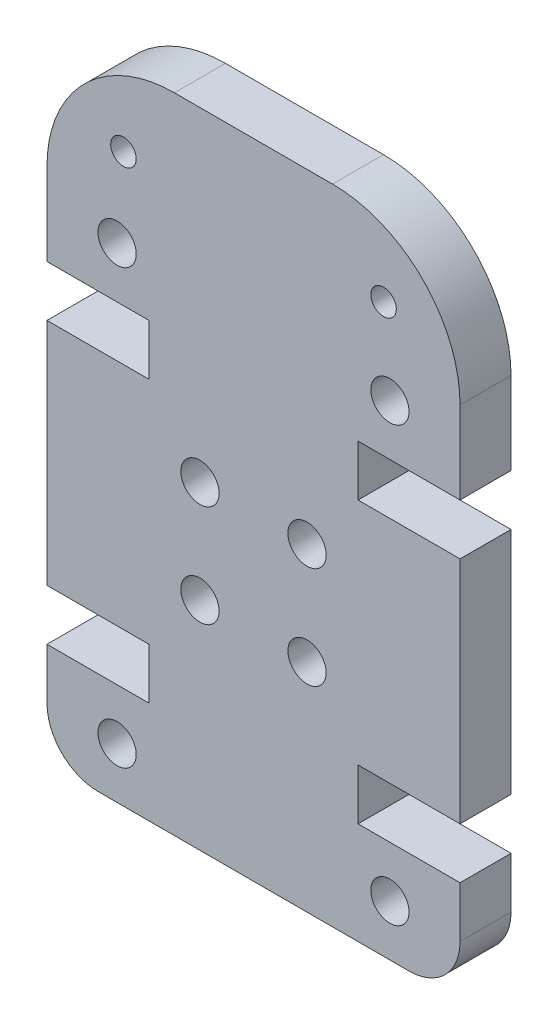
ISO-10303-21;
HEADER;
FILE_DESCRIPTION(('STEP AP214'),'2;1');
FILE_NAME('part.step','',(''),(''),'','','');
FILE_SCHEMA(('AUTOMOTIVE_DESIGN { 1 0 10303 214 1 1 1 1 }'));
ENDSEC;
DATA;
#1=APPLICATION_CONTEXT('core data for automotive mechanical design processes');
#2=APPLICATION_PROTOCOL_DEFINITION('international standard','automotive_design',2000,#1);
#3=PRODUCT_CONTEXT('',#1,'mechanical');
#4=PRODUCT('Part','Part','',(#3));
#5=PRODUCT_RELATED_PRODUCT_CATEGORY('part','',(#4));
#6=PRODUCT_DEFINITION_FORMATION('','',#4);
#7=PRODUCT_DEFINITION_CONTEXT('part definition',#1,'design');
#8=PRODUCT_DEFINITION('design','',#6,#7);
#9=PRODUCT_DEFINITION_SHAPE('','',#8);
#10=(LENGTH_UNIT() NAMED_UNIT(*) SI_UNIT(.MILLI.,.METRE.));
#11=(NAMED_UNIT(*) PLANE_ANGLE_UNIT() SI_UNIT($,.RADIAN.));
#12=(NAMED_UNIT(*) SI_UNIT($,.STERADIAN.) SOLID_ANGLE_UNIT());
#13=UNCERTAINTY_MEASURE_WITH_UNIT(LENGTH_MEASURE(1.E-05),#10,'distance_accuracy_value','');
#14=(GEOMETRIC_REPRESENTATION_CONTEXT(3) GLOBAL_UNCERTAINTY_ASSIGNED_CONTEXT((#13)) GLOBAL_UNIT_ASSIGNED_CONTEXT((#10,
#11,#12)) REPRESENTATION_CONTEXT('',''));
#15=CARTESIAN_POINT('',(0.,0.,0.));
#16=DIRECTION('',(0.,0.,1.));
#17=DIRECTION('',(1.,0.,0.));
#18=AXIS2_PLACEMENT_3D('',#15,#16,#17);
#19=CARTESIAN_POINT('',(14.2,2.00000000000003,2.));
#20=DIRECTION('',(0.,0.,-1.));
#21=DIRECTION('',(-1.,0.,0.));
#22=AXIS2_PLACEMENT_3D('',#19,#20,#21);
#23=PLANE('',#22);
#24=CARTESIAN_POINT('',(3.00000000000323,22.2299999999968,2.));
#25=DIRECTION('',(0.,0.,1.));
#26=DIRECTION('',(1.,0.,0.));
#27=AXIS2_PLACEMENT_3D('',#24,#25,#26);
#28=CIRCLE('',#27,0.499999999999944);
#29=CARTESIAN_POINT('',(3.50000000000317,22.2299999999968,2.));
#30=VERTEX_POINT('',#29);
#31=EDGE_CURVE('E472',#30,#30,#28,.T.);
#32=ORIENTED_EDGE('',*,*,#31,.F.);
#33=EDGE_LOOP('',(#32));
#34=FACE_BOUND('',#33,.T.);
#35=CARTESIAN_POINT('',(2.75000000000002,19.0000000000043,2.));
#36=DIRECTION('',(0.,0.,1.));
#37=DIRECTION('',(-1.,0.,0.));
#38=AXIS2_PLACEMENT_3D('',#35,#36,#37);
#39=CIRCLE('',#38,0.749999999999999);
#40=CARTESIAN_POINT('',(2.00000000000002,19.0000000000043,2.));
#41=VERTEX_POINT('',#40);
#42=EDGE_CURVE('E484',#41,#41,#39,.T.);
#43=ORIENTED_EDGE('',*,*,#42,.F.);
#44=EDGE_LOOP('',(#43));
#45=FACE_BOUND('',#44,.T.);
#46=CARTESIAN_POINT('',(10.1999999999989,12.5000000000022,2.));
#47=DIRECTION('',(0.,0.,1.));
#48=DIRECTION('',(1.,0.,0.));
#49=AXIS2_PLACEMENT_3D('',#46,#47,#48);
#50=CIRCLE('',#49,0.749999999999998);
#51=CARTESIAN_POINT('',(10.9499999999989,12.5000000000022,2.));
#52=VERTEX_POINT('',#51);
#53=EDGE_CURVE('E496',#52,#52,#50,.T.);
#54=ORIENTED_EDGE('',*,*,#53,.F.);
#55=EDGE_LOOP('',(#54));
#56=FACE_BOUND('',#55,.T.);
#57=CARTESIAN_POINT('',(10.1999999999989,8.5000000000022,2.));
#58=DIRECTION('',(0.,0.,1.));
#59=DIRECTION('',(-1.,0.,0.));
#60=AXIS2_PLACEMENT_3D('',#57,#58,#59);
#61=CIRCLE('',#60,0.749999999999998);
#62=CARTESIAN_POINT('',(9.44999999999887,8.5000000000022,2.));
#63=VERTEX_POINT('',#62);
#64=EDGE_CURVE('E508',#63,#63,#61,.T.);
#65=ORIENTED_EDGE('',*,*,#64,.F.);
#66=EDGE_LOOP('',(#65));
#67=FACE_BOUND('',#66,.T.);
#68=CARTESIAN_POINT('',(13.45,2.00000000000003,2.));
#69=DIRECTION('',(0.,0.,1.));
#70=DIRECTION('',(-1.,0.,0.));
#71=AXIS2_PLACEMENT_3D('',#68,#69,#70);
#72=CIRCLE('',#71,0.75);
#73=CARTESIAN_POINT('',(12.7,2.00000000000003,2.));
#74=VERTEX_POINT('',#73);
#75=EDGE_CURVE('E230',#74,#74,#72,.T.);
#76=ORIENTED_EDGE('',*,*,#75,.F.);
#77=EDGE_LOOP('',(#76));
#78=FACE_BOUND('',#77,.T.);
#79=CARTESIAN_POINT('',(14.2,2.00000000000003,2.));
#80=DIRECTION('',(0.,0.,1.));
#81=DIRECTION('',(-1.,0.,0.));
#82=AXIS2_PLACEMENT_3D('',#79,#80,#81);
#83=CIRCLE('',#82,2.00000000000003);
#84=CARTESIAN_POINT('',(14.2,0.,2.));
#85=VERTEX_POINT('',#84);
#86=CARTESIAN_POINT('',(16.2,2.00000000000003,2.));
#87=VERTEX_POINT('',#86);
#88=EDGE_CURVE('E273',#85,#87,#83,.T.);
#89=ORIENTED_EDGE('',*,*,#88,.T.);
#90=DIRECTION('',(0.,1.,0.));
#91=VECTOR('',#90,1.);
#92=CARTESIAN_POINT('',(16.2,2.00000000000003,2.));
#93=LINE('',#92,#91);
#94=CARTESIAN_POINT('',(16.2,4.00000000000006,2.));
#95=VERTEX_POINT('',#94);
#96=EDGE_CURVE('E141',#87,#95,#93,.T.);
#97=ORIENTED_EDGE('',*,*,#96,.T.);
#98=DIRECTION('',(-1.,0.,0.));
#99=VECTOR('',#98,1.);
#100=CARTESIAN_POINT('',(12.1999999999999,4.00000000000006,2.));
#101=LINE('',#100,#99);
#102=CARTESIAN_POINT('',(12.1999999999999,4.00000000000006,2.));
#103=VERTEX_POINT('',#102);
#104=EDGE_CURVE('E336',#95,#103,#101,.T.);
#105=ORIENTED_EDGE('',*,*,#104,.T.);
#106=DIRECTION('',(0.,1.,0.));
#107=VECTOR('',#106,1.);
#108=CARTESIAN_POINT('',(12.1999999999999,6.00000000000009,2.));
#109=LINE('',#108,#107);
#110=CARTESIAN_POINT('',(12.1999999999999,6.00000000000009,2.));
#111=VERTEX_POINT('',#110);
#112=EDGE_CURVE('E355',#103,#111,#109,.T.);
#113=ORIENTED_EDGE('',*,*,#112,.T.);
#114=DIRECTION('',(1.,0.,0.));
#115=VECTOR('',#114,1.);
#116=CARTESIAN_POINT('',(16.2,6.00000000000009,2.));
#117=LINE('',#116,#115);
#118=CARTESIAN_POINT('',(16.2,6.00000000000009,2.));
#119=VERTEX_POINT('',#118);
#120=EDGE_CURVE('E352',#111,#119,#117,.T.);
#121=ORIENTED_EDGE('',*,*,#120,.T.);
#122=DIRECTION('',(0.,1.,0.));
#123=VECTOR('',#122,1.);
#124=CARTESIAN_POINT('',(16.2,6.00000000000009,2.));
#125=LINE('',#124,#123);
#126=CARTESIAN_POINT('',(16.2,15.0000000000043,2.));
#127=VERTEX_POINT('',#126);
#128=EDGE_CURVE('E354',#119,#127,#125,.T.);
#129=ORIENTED_EDGE('',*,*,#128,.T.);
#130=DIRECTION('',(-1.,0.,0.));
#131=VECTOR('',#130,1.);
#132=CARTESIAN_POINT('',(16.2,15.0000000000043,2.));
#133=LINE('',#132,#131);
#134=CARTESIAN_POINT('',(12.1999999999999,15.0000000000043,2.));
#135=VERTEX_POINT('',#134);
#136=EDGE_CURVE('E357',#127,#135,#133,.T.);
#137=ORIENTED_EDGE('',*,*,#136,.T.);
#138=DIRECTION('',(0.,1.,0.));
#139=VECTOR('',#138,1.);
#140=CARTESIAN_POINT('',(12.1999999999999,15.0000000000043,2.));
#141=LINE('',#140,#139);
#142=CARTESIAN_POINT('',(12.1999999999999,17.0000000000043,2.));
#143=VERTEX_POINT('',#142);
#144=EDGE_CURVE('E363',#135,#143,#141,.T.);
#145=ORIENTED_EDGE('',*,*,#144,.T.);
#146=DIRECTION('',(1.,0.,0.));
#147=VECTOR('',#146,1.);
#148=CARTESIAN_POINT('',(12.1999999999999,17.0000000000043,2.));
#149=LINE('',#148,#147);
#150=CARTESIAN_POINT('',(16.2,17.0000000000043,2.));
#151=VERTEX_POINT('',#150);
#152=EDGE_CURVE('E365',#143,#151,#149,.T.);
#153=ORIENTED_EDGE('',*,*,#152,.T.);
#154=DIRECTION('',(0.,1.,0.));
#155=VECTOR('',#154,1.);
#156=CARTESIAN_POINT('',(16.2,20.23,2.));
#157=LINE('',#156,#155);
#158=CARTESIAN_POINT('',(16.2,20.23,2.));
#159=VERTEX_POINT('',#158);
#160=EDGE_CURVE('E367',#151,#159,#157,.T.);
#161=ORIENTED_EDGE('',*,*,#160,.T.);
#162=CARTESIAN_POINT('',(11.2,20.23,2.));
#163=DIRECTION('',(0.,0.,1.));
#164=DIRECTION('',(-1.,0.,0.));
#165=AXIS2_PLACEMENT_3D('',#162,#163,#164);
#166=CIRCLE('',#165,5.00000000000002);
#167=CARTESIAN_POINT('',(11.2,25.23,2.));
#168=VERTEX_POINT('',#167);
#169=EDGE_CURVE('E369',#159,#168,#166,.T.);
#170=ORIENTED_EDGE('',*,*,#169,.T.);
#171=DIRECTION('',(-1.,0.,0.));
#172=VECTOR('',#171,1.);
#173=CARTESIAN_POINT('',(5.00000000000002,25.23,2.));
#174=LINE('',#173,#172);
#175=CARTESIAN_POINT('',(5.00000000000002,25.23,2.));
#176=VERTEX_POINT('',#175);
#177=EDGE_CURVE('E371',#168,#176,#174,.T.);
#178=ORIENTED_EDGE('',*,*,#177,.T.);
#179=CARTESIAN_POINT('',(5.00000000000002,20.23,2.));
#180=DIRECTION('',(0.,0.,1.));
#181=DIRECTION('',(1.,0.,0.));
#182=AXIS2_PLACEMENT_3D('',#179,#180,#181);
#183=CIRCLE('',#182,5.00000000000002);
#184=CARTESIAN_POINT('',(0.,20.23,2.));
#185=VERTEX_POINT('',#184);
#186=EDGE_CURVE('E373',#176,#185,#183,.T.);
#187=ORIENTED_EDGE('',*,*,#186,.T.);
#188=DIRECTION('',(0.,-1.,0.));
#189=VECTOR('',#188,1.);
#190=CARTESIAN_POINT('',(0.,20.23,2.));
#191=LINE('',#190,#189);
#192=CARTESIAN_POINT('',(0.,17.0000000000043,2.));
#193=VERTEX_POINT('',#192);
#194=EDGE_CURVE('E375',#185,#193,#191,.T.);
#195=ORIENTED_EDGE('',*,*,#194,.T.);
#196=DIRECTION('',(1.,0.,0.));
#197=VECTOR('',#196,1.);
#198=CARTESIAN_POINT('',(4.00000000000004,17.0000000000043,2.));
#199=LINE('',#198,#197);
#200=CARTESIAN_POINT('',(4.00000000000004,17.0000000000043,2.));
#201=VERTEX_POINT('',#200);
#202=EDGE_CURVE('E377',#193,#201,#199,.T.);
#203=ORIENTED_EDGE('',*,*,#202,.T.);
#204=DIRECTION('',(0.,-1.,0.));
#205=VECTOR('',#204,1.);
#206=CARTESIAN_POINT('',(4.00000000000004,15.0000000000043,2.));
#207=LINE('',#206,#205);
#208=CARTESIAN_POINT('',(4.00000000000004,15.0000000000043,2.));
#209=VERTEX_POINT('',#208);
#210=EDGE_CURVE('E379',#201,#209,#207,.T.);
#211=ORIENTED_EDGE('',*,*,#210,.T.);
#212=DIRECTION('',(-1.,0.,0.));
#213=VECTOR('',#212,1.);
#214=CARTESIAN_POINT('',(0.,15.0000000000043,2.));
#215=LINE('',#214,#213);
#216=CARTESIAN_POINT('',(0.,15.0000000000043,2.));
#217=VERTEX_POINT('',#216);
#218=EDGE_CURVE('E381',#209,#217,#215,.T.);
#219=ORIENTED_EDGE('',*,*,#218,.T.);
#220=DIRECTION('',(0.,-1.,0.));
#221=VECTOR('',#220,1.);
#222=CARTESIAN_POINT('',(0.,6.00000000000003,2.));
#223=LINE('',#222,#221);
#224=CARTESIAN_POINT('',(0.,6.00000000000003,2.));
#225=VERTEX_POINT('',#224);
#226=EDGE_CURVE('E383',#217,#225,#223,.T.);
#227=ORIENTED_EDGE('',*,*,#226,.T.);
#228=DIRECTION('',(1.,0.,0.));
#229=VECTOR('',#228,1.);
#230=CARTESIAN_POINT('',(0.,6.00000000000003,2.));
#231=LINE('',#230,#229);
#232=CARTESIAN_POINT('',(4.00000000000004,6.00000000000003,2.));
#233=VERTEX_POINT('',#232);
#234=EDGE_CURVE('E385',#225,#233,#231,.T.);
#235=ORIENTED_EDGE('',*,*,#234,.T.);
#236=DIRECTION('',(0.,-1.,0.));
#237=VECTOR('',#236,1.);
#238=CARTESIAN_POINT('',(4.00000000000004,6.00000000000003,2.));
#239=LINE('',#238,#237);
#240=CARTESIAN_POINT('',(4.00000000000004,4.00000000000002,2.));
#241=VERTEX_POINT('',#240);
#242=EDGE_CURVE('E387',#233,#241,#239,.T.);
#243=ORIENTED_EDGE('',*,*,#242,.T.);
#244=DIRECTION('',(-1.,0.,0.));
#245=VECTOR('',#244,1.);
#246=CARTESIAN_POINT('',(4.00000000000004,4.00000000000002,2.));
#247=LINE('',#246,#245);
#248=CARTESIAN_POINT('',(0.,4.,2.));
#249=VERTEX_POINT('',#248);
#250=EDGE_CURVE('E208',#241,#249,#247,.T.);
#251=ORIENTED_EDGE('',*,*,#250,.T.);
#252=DIRECTION('',(0.,-1.,0.));
#253=VECTOR('',#252,1.);
#254=CARTESIAN_POINT('',(0.,2.00000000000003,2.));
#255=LINE('',#254,#253);
#256=CARTESIAN_POINT('',(0.,2.00000000000003,2.));
#257=VERTEX_POINT('',#256);
#258=EDGE_CURVE('E202',#249,#257,#255,.T.);
#259=ORIENTED_EDGE('',*,*,#258,.T.);
#260=CARTESIAN_POINT('',(2.00000000000001,2.00000000000003,2.));
#261=DIRECTION('',(0.,0.,1.));
#262=DIRECTION('',(1.,0.,0.));
#263=AXIS2_PLACEMENT_3D('',#260,#261,#262);
#264=CIRCLE('',#263,2.00000000000001);
#265=CARTESIAN_POINT('',(2.00000000000001,0.,2.));
#266=VERTEX_POINT('',#265);
#267=EDGE_CURVE('E206',#257,#266,#264,.T.);
#268=ORIENTED_EDGE('',*,*,#267,.T.);
#269=DIRECTION('',(1.,0.,0.));
#270=VECTOR('',#269,1.);
#271=CARTESIAN_POINT('',(2.00000000000001,0.,2.));
#272=LINE('',#271,#270);
#273=EDGE_CURVE('E50',#266,#85,#272,.T.);
#274=ORIENTED_EDGE('',*,*,#273,.T.);
#275=EDGE_LOOP('',(#89,#97,#105,#113,#121,#129,#137,#145,#153,#161,#170,#178,#187,#195,#203,
#211,#219,#227,#235,#243,#251,#259,#268,#274));
#276=FACE_BOUND('',#275,.T.);
#277=CARTESIAN_POINT('',(13.1999999999968,22.2299999999968,2.));
#278=DIRECTION('',(0.,0.,1.));
#279=DIRECTION('',(-1.,0.,0.));
#280=AXIS2_PLACEMENT_3D('',#277,#278,#279);
#281=CIRCLE('',#280,0.499999999999944);
#282=CARTESIAN_POINT('',(12.6999999999968,22.2299999999968,2.));
#283=VERTEX_POINT('',#282);
#284=EDGE_CURVE('E514',#283,#283,#281,.T.);
#285=ORIENTED_EDGE('',*,*,#284,.F.);
#286=EDGE_LOOP('',(#285));
#287=FACE_BOUND('',#286,.T.);
#288=CARTESIAN_POINT('',(13.45,19.0000000000043,2.));
#289=DIRECTION('',(0.,0.,1.));
#290=DIRECTION('',(1.,0.,0.));
#291=AXIS2_PLACEMENT_3D('',#288,#289,#290);
#292=CIRCLE('',#291,0.749999999999999);
#293=CARTESIAN_POINT('',(14.2,19.0000000000043,2.));
#294=VERTEX_POINT('',#293);
#295=EDGE_CURVE('E502',#294,#294,#292,.T.);
#296=ORIENTED_EDGE('',*,*,#295,.F.);
#297=EDGE_LOOP('',(#296));
#298=FACE_BOUND('',#297,.T.);
#299=CARTESIAN_POINT('',(6.00000000000113,8.5000000000022,2.));
#300=DIRECTION('',(0.,0.,1.));
#301=DIRECTION('',(1.,0.,0.));
#302=AXIS2_PLACEMENT_3D('',#299,#300,#301);
#303=CIRCLE('',#302,0.749999999999999);
#304=CARTESIAN_POINT('',(6.75000000000113,8.5000000000022,2.));
#305=VERTEX_POINT('',#304);
#306=EDGE_CURVE('E490',#305,#305,#303,.T.);
#307=ORIENTED_EDGE('',*,*,#306,.F.);
#308=EDGE_LOOP('',(#307));
#309=FACE_BOUND('',#308,.T.);
#310=CARTESIAN_POINT('',(6.00000000000113,12.5000000000022,2.));
#311=DIRECTION('',(0.,0.,1.));
#312=DIRECTION('',(-1.,0.,0.));
#313=AXIS2_PLACEMENT_3D('',#310,#311,#312);
#314=CIRCLE('',#313,0.749999999999999);
#315=CARTESIAN_POINT('',(5.25000000000113,12.5000000000022,2.));
#316=VERTEX_POINT('',#315);
#317=EDGE_CURVE('E478',#316,#316,#314,.T.);
#318=ORIENTED_EDGE('',*,*,#317,.F.);
#319=EDGE_LOOP('',(#318));
#320=FACE_BOUND('',#319,.T.);
#321=CARTESIAN_POINT('',(2.75000000000002,2.00000000000025,2.));
#322=DIRECTION('',(0.,0.,1.));
#323=DIRECTION('',(1.,0.,0.));
#324=AXIS2_PLACEMENT_3D('',#321,#322,#323);
#325=CIRCLE('',#324,0.750000000002987);
#326=CARTESIAN_POINT('',(3.50000000000301,2.00000000000025,2.));
#327=VERTEX_POINT('',#326);
#328=EDGE_CURVE('E463',#327,#327,#325,.T.);
#329=ORIENTED_EDGE('',*,*,#328,.F.);
#330=EDGE_LOOP('',(#329));
#331=FACE_BOUND('',#330,.T.);
#332=ADVANCED_FACE('F33',(#34,#45,#56,#67,#78,#276,#287,#298,#309,#320,#331),#23,.F.);
#333=CARTESIAN_POINT('',(14.2,2.00000000000003,0.));
#334=DIRECTION('',(0.,0.,-1.));
#335=DIRECTION('',(-1.,0.,0.));
#336=AXIS2_PLACEMENT_3D('',#333,#334,#335);
#337=PLANE('',#336);
#338=CARTESIAN_POINT('',(3.00000000000323,22.2299999999968,0.));
#339=DIRECTION('',(0.,0.,1.));
#340=DIRECTION('',(1.,0.,0.));
#341=AXIS2_PLACEMENT_3D('',#338,#339,#340);
#342=CIRCLE('',#341,0.499999999999944);
#343=CARTESIAN_POINT('',(3.50000000000317,22.2299999999968,0.));
#344=VERTEX_POINT('',#343);
#345=EDGE_CURVE('E469',#344,#344,#342,.T.);
#346=ORIENTED_EDGE('',*,*,#345,.T.);
#347=EDGE_LOOP('',(#346));
#348=FACE_BOUND('',#347,.T.);
#349=CARTESIAN_POINT('',(2.75000000000002,19.0000000000043,0.));
#350=DIRECTION('',(0.,0.,1.));
#351=DIRECTION('',(-1.,0.,0.));
#352=AXIS2_PLACEMENT_3D('',#349,#350,#351);
#353=CIRCLE('',#352,0.749999999999999);
#354=CARTESIAN_POINT('',(2.00000000000002,19.0000000000043,0.));
#355=VERTEX_POINT('',#354);
#356=EDGE_CURVE('E481',#355,#355,#353,.T.);
#357=ORIENTED_EDGE('',*,*,#356,.T.);
#358=EDGE_LOOP('',(#357));
#359=FACE_BOUND('',#358,.T.);
#360=CARTESIAN_POINT('',(10.1999999999989,12.5000000000022,0.));
#361=DIRECTION('',(0.,0.,1.));
#362=DIRECTION('',(1.,0.,0.));
#363=AXIS2_PLACEMENT_3D('',#360,#361,#362);
#364=CIRCLE('',#363,0.749999999999998);
#365=CARTESIAN_POINT('',(10.9499999999989,12.5000000000022,0.));
#366=VERTEX_POINT('',#365);
#367=EDGE_CURVE('E493',#366,#366,#364,.T.);
#368=ORIENTED_EDGE('',*,*,#367,.T.);
#369=EDGE_LOOP('',(#368));
#370=FACE_BOUND('',#369,.T.);
#371=CARTESIAN_POINT('',(10.1999999999989,8.5000000000022,0.));
#372=DIRECTION('',(0.,0.,1.));
#373=DIRECTION('',(-1.,0.,0.));
#374=AXIS2_PLACEMENT_3D('',#371,#372,#373);
#375=CIRCLE('',#374,0.749999999999998);
#376=CARTESIAN_POINT('',(9.44999999999887,8.5000000000022,0.));
#377=VERTEX_POINT('',#376);
#378=EDGE_CURVE('E505',#377,#377,#375,.T.);
#379=ORIENTED_EDGE('',*,*,#378,.T.);
#380=EDGE_LOOP('',(#379));
#381=FACE_BOUND('',#380,.T.);
#382=CARTESIAN_POINT('',(13.45,2.00000000000003,0.));
#383=DIRECTION('',(0.,0.,1.));
#384=DIRECTION('',(-1.,0.,0.));
#385=AXIS2_PLACEMENT_3D('',#382,#383,#384);
#386=CIRCLE('',#385,0.75);
#387=CARTESIAN_POINT('',(12.7,2.00000000000003,0.));
#388=VERTEX_POINT('',#387);
#389=EDGE_CURVE('E517',#388,#388,#386,.T.);
#390=ORIENTED_EDGE('',*,*,#389,.T.);
#391=EDGE_LOOP('',(#390));
#392=FACE_BOUND('',#391,.T.);
#393=CARTESIAN_POINT('',(14.2,2.00000000000003,0.));
#394=DIRECTION('',(0.,0.,1.));
#395=DIRECTION('',(-1.,0.,0.));
#396=AXIS2_PLACEMENT_3D('',#393,#394,#395);
#397=CIRCLE('',#396,2.00000000000003);
#398=CARTESIAN_POINT('',(14.2,0.,0.));
#399=VERTEX_POINT('',#398);
#400=CARTESIAN_POINT('',(16.2,2.00000000000003,0.));
#401=VERTEX_POINT('',#400);
#402=EDGE_CURVE('E226',#399,#401,#397,.T.);
#403=ORIENTED_EDGE('',*,*,#402,.F.);
#404=DIRECTION('',(1.,0.,0.));
#405=VECTOR('',#404,1.);
#406=CARTESIAN_POINT('',(2.00000000000001,0.,0.));
#407=LINE('',#406,#405);
#408=CARTESIAN_POINT('',(2.00000000000001,0.,0.));
#409=VERTEX_POINT('',#408);
#410=EDGE_CURVE('E133',#409,#399,#407,.T.);
#411=ORIENTED_EDGE('',*,*,#410,.F.);
#412=CARTESIAN_POINT('',(2.00000000000001,2.00000000000003,0.));
#413=DIRECTION('',(0.,0.,1.));
#414=DIRECTION('',(1.,0.,0.));
#415=AXIS2_PLACEMENT_3D('',#412,#413,#414);
#416=CIRCLE('',#415,2.00000000000001);
#417=CARTESIAN_POINT('',(0.,2.00000000000003,0.));
#418=VERTEX_POINT('',#417);
#419=EDGE_CURVE('E127',#418,#409,#416,.T.);
#420=ORIENTED_EDGE('',*,*,#419,.F.);
#421=DIRECTION('',(0.,-1.,0.));
#422=VECTOR('',#421,1.);
#423=CARTESIAN_POINT('',(0.,2.00000000000003,0.));
#424=LINE('',#423,#422);
#425=CARTESIAN_POINT('',(0.,4.,0.));
#426=VERTEX_POINT('',#425);
#427=EDGE_CURVE('E216',#426,#418,#424,.T.);
#428=ORIENTED_EDGE('',*,*,#427,.F.);
#429=DIRECTION('',(-1.,0.,0.));
#430=VECTOR('',#429,1.);
#431=CARTESIAN_POINT('',(4.00000000000004,4.00000000000002,0.));
#432=LINE('',#431,#430);
#433=CARTESIAN_POINT('',(4.00000000000004,4.00000000000002,0.));
#434=VERTEX_POINT('',#433);
#435=EDGE_CURVE('E268',#434,#426,#432,.T.);
#436=ORIENTED_EDGE('',*,*,#435,.F.);
#437=DIRECTION('',(0.,-1.,0.));
#438=VECTOR('',#437,1.);
#439=CARTESIAN_POINT('',(4.00000000000004,6.00000000000003,0.));
#440=LINE('',#439,#438);
#441=CARTESIAN_POINT('',(4.00000000000004,6.00000000000003,0.));
#442=VERTEX_POINT('',#441);
#443=EDGE_CURVE('E266',#442,#434,#440,.T.);
#444=ORIENTED_EDGE('',*,*,#443,.F.);
#445=DIRECTION('',(1.,0.,0.));
#446=VECTOR('',#445,1.);
#447=CARTESIAN_POINT('',(0.,6.00000000000003,0.));
#448=LINE('',#447,#446);
#449=CARTESIAN_POINT('',(0.,6.00000000000003,0.));
#450=VERTEX_POINT('',#449);
#451=EDGE_CURVE('E264',#450,#442,#448,.T.);
#452=ORIENTED_EDGE('',*,*,#451,.F.);
#453=DIRECTION('',(0.,-1.,0.));
#454=VECTOR('',#453,1.);
#455=CARTESIAN_POINT('',(0.,6.00000000000003,0.));
#456=LINE('',#455,#454);
#457=CARTESIAN_POINT('',(0.,15.0000000000043,0.));
#458=VERTEX_POINT('',#457);
#459=EDGE_CURVE('E262',#458,#450,#456,.T.);
#460=ORIENTED_EDGE('',*,*,#459,.F.);
#461=DIRECTION('',(-1.,0.,0.));
#462=VECTOR('',#461,1.);
#463=CARTESIAN_POINT('',(0.,15.0000000000043,0.));
#464=LINE('',#463,#462);
#465=CARTESIAN_POINT('',(4.00000000000004,15.0000000000043,0.));
#466=VERTEX_POINT('',#465);
#467=EDGE_CURVE('E260',#466,#458,#464,.T.);
#468=ORIENTED_EDGE('',*,*,#467,.F.);
#469=DIRECTION('',(0.,-1.,0.));
#470=VECTOR('',#469,1.);
#471=CARTESIAN_POINT('',(4.00000000000004,15.0000000000043,0.));
#472=LINE('',#471,#470);
#473=CARTESIAN_POINT('',(4.00000000000004,17.0000000000043,0.));
#474=VERTEX_POINT('',#473);
#475=EDGE_CURVE('E258',#474,#466,#472,.T.);
#476=ORIENTED_EDGE('',*,*,#475,.F.);
#477=DIRECTION('',(1.,0.,0.));
#478=VECTOR('',#477,1.);
#479=CARTESIAN_POINT('',(4.00000000000004,17.0000000000043,0.));
#480=LINE('',#479,#478);
#481=CARTESIAN_POINT('',(0.,17.0000000000043,0.));
#482=VERTEX_POINT('',#481);
#483=EDGE_CURVE('E256',#482,#474,#480,.T.);
#484=ORIENTED_EDGE('',*,*,#483,.F.);
#485=DIRECTION('',(0.,-1.,0.));
#486=VECTOR('',#485,1.);
#487=CARTESIAN_POINT('',(0.,20.23,0.));
#488=LINE('',#487,#486);
#489=CARTESIAN_POINT('',(0.,20.23,0.));
#490=VERTEX_POINT('',#489);
#491=EDGE_CURVE('E254',#490,#482,#488,.T.);
#492=ORIENTED_EDGE('',*,*,#491,.F.);
#493=CARTESIAN_POINT('',(5.00000000000002,20.23,0.));
#494=DIRECTION('',(0.,0.,1.));
#495=DIRECTION('',(1.,0.,0.));
#496=AXIS2_PLACEMENT_3D('',#493,#494,#495);
#497=CIRCLE('',#496,5.00000000000002);
#498=CARTESIAN_POINT('',(5.00000000000002,25.23,0.));
#499=VERTEX_POINT('',#498);
#500=EDGE_CURVE('E252',#499,#490,#497,.T.);
#501=ORIENTED_EDGE('',*,*,#500,.F.);
#502=DIRECTION('',(-1.,0.,0.));
#503=VECTOR('',#502,1.);
#504=CARTESIAN_POINT('',(5.00000000000002,25.23,0.));
#505=LINE('',#504,#503);
#506=CARTESIAN_POINT('',(11.2,25.23,0.));
#507=VERTEX_POINT('',#506);
#508=EDGE_CURVE('E250',#507,#499,#505,.T.);
#509=ORIENTED_EDGE('',*,*,#508,.F.);
#510=CARTESIAN_POINT('',(11.2,20.23,0.));
#511=DIRECTION('',(0.,0.,1.));
#512=DIRECTION('',(-1.,0.,0.));
#513=AXIS2_PLACEMENT_3D('',#510,#511,#512);
#514=CIRCLE('',#513,5.00000000000002);
#515=CARTESIAN_POINT('',(16.2,20.23,0.));
#516=VERTEX_POINT('',#515);
#517=EDGE_CURVE('E248',#516,#507,#514,.T.);
#518=ORIENTED_EDGE('',*,*,#517,.F.);
#519=DIRECTION('',(0.,1.,0.));
#520=VECTOR('',#519,1.);
#521=CARTESIAN_POINT('',(16.2,20.23,0.));
#522=LINE('',#521,#520);
#523=CARTESIAN_POINT('',(16.2,17.0000000000043,0.));
#524=VERTEX_POINT('',#523);
#525=EDGE_CURVE('E246',#524,#516,#522,.T.);
#526=ORIENTED_EDGE('',*,*,#525,.F.);
#527=DIRECTION('',(1.,0.,0.));
#528=VECTOR('',#527,1.);
#529=CARTESIAN_POINT('',(12.1999999999999,17.0000000000043,0.));
#530=LINE('',#529,#528);
#531=CARTESIAN_POINT('',(12.1999999999999,17.0000000000043,0.));
#532=VERTEX_POINT('',#531);
#533=EDGE_CURVE('E244',#532,#524,#530,.T.);
#534=ORIENTED_EDGE('',*,*,#533,.F.);
#535=DIRECTION('',(0.,1.,0.));
#536=VECTOR('',#535,1.);
#537=CARTESIAN_POINT('',(12.1999999999999,15.0000000000043,0.));
#538=LINE('',#537,#536);
#539=CARTESIAN_POINT('',(12.1999999999999,15.0000000000043,0.));
#540=VERTEX_POINT('',#539);
#541=EDGE_CURVE('E242',#540,#532,#538,.T.);
#542=ORIENTED_EDGE('',*,*,#541,.F.);
#543=DIRECTION('',(-1.,0.,0.));
#544=VECTOR('',#543,1.);
#545=CARTESIAN_POINT('',(16.2,15.0000000000043,0.));
#546=LINE('',#545,#544);
#547=CARTESIAN_POINT('',(16.2,15.0000000000043,0.));
#548=VERTEX_POINT('',#547);
#549=EDGE_CURVE('E240',#548,#540,#546,.T.);
#550=ORIENTED_EDGE('',*,*,#549,.F.);
#551=DIRECTION('',(0.,1.,0.));
#552=VECTOR('',#551,1.);
#553=CARTESIAN_POINT('',(16.2,6.00000000000009,0.));
#554=LINE('',#553,#552);
#555=CARTESIAN_POINT('',(16.2,6.00000000000009,0.));
#556=VERTEX_POINT('',#555);
#557=EDGE_CURVE('E238',#556,#548,#554,.T.);
#558=ORIENTED_EDGE('',*,*,#557,.F.);
#559=DIRECTION('',(1.,0.,0.));
#560=VECTOR('',#559,1.);
#561=CARTESIAN_POINT('',(16.2,6.00000000000009,0.));
#562=LINE('',#561,#560);
#563=CARTESIAN_POINT('',(12.1999999999999,6.00000000000009,0.));
#564=VERTEX_POINT('',#563);
#565=EDGE_CURVE('E236',#564,#556,#562,.T.);
#566=ORIENTED_EDGE('',*,*,#565,.F.);
#567=DIRECTION('',(0.,1.,0.));
#568=VECTOR('',#567,1.);
#569=CARTESIAN_POINT('',(12.1999999999999,6.00000000000009,0.));
#570=LINE('',#569,#568);
#571=CARTESIAN_POINT('',(12.1999999999999,4.00000000000006,0.));
#572=VERTEX_POINT('',#571);
#573=EDGE_CURVE('E234',#572,#564,#570,.T.);
#574=ORIENTED_EDGE('',*,*,#573,.F.);
#575=DIRECTION('',(-1.,0.,0.));
#576=VECTOR('',#575,1.);
#577=CARTESIAN_POINT('',(12.1999999999999,4.00000000000006,0.));
#578=LINE('',#577,#576);
#579=CARTESIAN_POINT('',(16.2,4.00000000000006,0.));
#580=VERTEX_POINT('',#579);
#581=EDGE_CURVE('E232',#580,#572,#578,.T.);
#582=ORIENTED_EDGE('',*,*,#581,.F.);
#583=DIRECTION('',(0.,1.,0.));
#584=VECTOR('',#583,1.);
#585=CARTESIAN_POINT('',(16.2,2.00000000000003,0.));
#586=LINE('',#585,#584);
#587=EDGE_CURVE('E229',#401,#580,#586,.T.);
#588=ORIENTED_EDGE('',*,*,#587,.F.);
#589=EDGE_LOOP('',(#403,#411,#420,#428,#436,#444,#452,#460,#468,#476,#484,#492,#501,#509,#518,
#526,#534,#542,#550,#558,#566,#574,#582,#588));
#590=FACE_BOUND('',#589,.T.);
#591=CARTESIAN_POINT('',(13.1999999999968,22.2299999999968,0.));
#592=DIRECTION('',(0.,0.,1.));
#593=DIRECTION('',(-1.,0.,0.));
#594=AXIS2_PLACEMENT_3D('',#591,#592,#593);
#595=CIRCLE('',#594,0.499999999999944);
#596=CARTESIAN_POINT('',(12.6999999999968,22.2299999999968,0.));
#597=VERTEX_POINT('',#596);
#598=EDGE_CURVE('E511',#597,#597,#595,.T.);
#599=ORIENTED_EDGE('',*,*,#598,.T.);
#600=EDGE_LOOP('',(#599));
#601=FACE_BOUND('',#600,.T.);
#602=CARTESIAN_POINT('',(13.45,19.0000000000043,0.));
#603=DIRECTION('',(0.,0.,1.));
#604=DIRECTION('',(1.,0.,0.));
#605=AXIS2_PLACEMENT_3D('',#602,#603,#604);
#606=CIRCLE('',#605,0.749999999999999);
#607=CARTESIAN_POINT('',(14.2,19.0000000000043,0.));
#608=VERTEX_POINT('',#607);
#609=EDGE_CURVE('E499',#608,#608,#606,.T.);
#610=ORIENTED_EDGE('',*,*,#609,.T.);
#611=EDGE_LOOP('',(#610));
#612=FACE_BOUND('',#611,.T.);
#613=CARTESIAN_POINT('',(6.00000000000113,8.5000000000022,0.));
#614=DIRECTION('',(0.,0.,1.));
#615=DIRECTION('',(1.,0.,0.));
#616=AXIS2_PLACEMENT_3D('',#613,#614,#615);
#617=CIRCLE('',#616,0.749999999999999);
#618=CARTESIAN_POINT('',(6.75000000000113,8.5000000000022,0.));
#619=VERTEX_POINT('',#618);
#620=EDGE_CURVE('E487',#619,#619,#617,.T.);
#621=ORIENTED_EDGE('',*,*,#620,.T.);
#622=EDGE_LOOP('',(#621));
#623=FACE_BOUND('',#622,.T.);
#624=CARTESIAN_POINT('',(6.00000000000113,12.5000000000022,0.));
#625=DIRECTION('',(0.,0.,1.));
#626=DIRECTION('',(-1.,0.,0.));
#627=AXIS2_PLACEMENT_3D('',#624,#625,#626);
#628=CIRCLE('',#627,0.749999999999999);
#629=CARTESIAN_POINT('',(5.25000000000113,12.5000000000022,0.));
#630=VERTEX_POINT('',#629);
#631=EDGE_CURVE('E475',#630,#630,#628,.T.);
#632=ORIENTED_EDGE('',*,*,#631,.T.);
#633=EDGE_LOOP('',(#632));
#634=FACE_BOUND('',#633,.T.);
#635=CARTESIAN_POINT('',(2.75000000000002,2.00000000000025,0.));
#636=DIRECTION('',(0.,0.,1.));
#637=DIRECTION('',(1.,0.,0.));
#638=AXIS2_PLACEMENT_3D('',#635,#636,#637);
#639=CIRCLE('',#638,0.750000000002987);
#640=CARTESIAN_POINT('',(3.50000000000301,2.00000000000025,0.));
#641=VERTEX_POINT('',#640);
#642=EDGE_CURVE('E466',#641,#641,#639,.T.);
#643=ORIENTED_EDGE('',*,*,#642,.T.);
#644=EDGE_LOOP('',(#643));
#645=FACE_BOUND('',#644,.T.);
#646=ADVANCED_FACE('F340',(#348,#359,#370,#381,#392,#590,#601,#612,#623,#634,#645),#337,.T.);
#647=CARTESIAN_POINT('',(14.2,2.00000000000003,2.));
#648=DIRECTION('',(0.,0.,-1.));
#649=DIRECTION('',(-1.,0.,0.));
#650=AXIS2_PLACEMENT_3D('',#647,#648,#649);
#651=CYLINDRICAL_SURFACE('',#650,2.00000000000003);
#652=ORIENTED_EDGE('',*,*,#402,.T.);
#653=DIRECTION('',(0.,0.,-1.));
#654=VECTOR('',#653,1.);
#655=CARTESIAN_POINT('',(16.2,2.00000000000003,2.));
#656=LINE('',#655,#654);
#657=EDGE_CURVE('E11',#87,#401,#656,.T.);
#658=ORIENTED_EDGE('',*,*,#657,.F.);
#659=ORIENTED_EDGE('',*,*,#88,.F.);
#660=DIRECTION('',(0.,0.,-1.));
#661=VECTOR('',#660,1.);
#662=CARTESIAN_POINT('',(14.2,0.,2.));
#663=LINE('',#662,#661);
#664=EDGE_CURVE('E222',#85,#399,#663,.T.);
#665=ORIENTED_EDGE('',*,*,#664,.T.);
#666=EDGE_LOOP('',(#652,#658,#659,#665));
#667=FACE_BOUND('',#666,.T.);
#668=ADVANCED_FACE('F35',(#667),#651,.T.);
#669=CARTESIAN_POINT('',(16.2,2.00000000000003,2.));
#670=DIRECTION('',(-1.,0.,0.));
#671=DIRECTION('',(0.,-1.,0.));
#672=AXIS2_PLACEMENT_3D('',#669,#670,#671);
#673=PLANE('',#672);
#674=ORIENTED_EDGE('',*,*,#587,.T.);
#675=DIRECTION('',(0.,0.,-1.));
#676=VECTOR('',#675,1.);
#677=CARTESIAN_POINT('',(16.2,4.00000000000006,2.));
#678=LINE('',#677,#676);
#679=EDGE_CURVE('E42',#95,#580,#678,.T.);
#680=ORIENTED_EDGE('',*,*,#679,.F.);
#681=ORIENTED_EDGE('',*,*,#96,.F.);
#682=ORIENTED_EDGE('',*,*,#657,.T.);
#683=EDGE_LOOP('',(#674,#680,#681,#682));
#684=FACE_BOUND('',#683,.T.);
#685=ADVANCED_FACE('F800',(#684),#673,.F.);
#686=CARTESIAN_POINT('',(12.1999999999999,4.00000000000006,2.));
#687=DIRECTION('',(0.,-1.,0.));
#688=DIRECTION('',(1.,0.,0.));
#689=AXIS2_PLACEMENT_3D('',#686,#687,#688);
#690=PLANE('',#689);
#691=ORIENTED_EDGE('',*,*,#581,.T.);
#692=DIRECTION('',(0.,0.,-1.));
#693=VECTOR('',#692,1.);
#694=CARTESIAN_POINT('',(12.1999999999999,4.00000000000006,2.));
#695=LINE('',#694,#693);
#696=EDGE_CURVE('E328',#103,#572,#695,.T.);
#697=ORIENTED_EDGE('',*,*,#696,.F.);
#698=ORIENTED_EDGE('',*,*,#104,.F.);
#699=ORIENTED_EDGE('',*,*,#679,.T.);
#700=EDGE_LOOP('',(#691,#697,#698,#699));
#701=FACE_BOUND('',#700,.T.);
#702=ADVANCED_FACE('F334',(#701),#690,.F.);
#703=CARTESIAN_POINT('',(12.1999999999999,6.00000000000009,2.));
#704=DIRECTION('',(-1.,0.,0.));
#705=DIRECTION('',(0.,0.,1.));
#706=AXIS2_PLACEMENT_3D('',#703,#704,#705);
#707=PLANE('',#706);
#708=ORIENTED_EDGE('',*,*,#573,.T.);
#709=DIRECTION('',(0.,0.,-1.));
#710=VECTOR('',#709,1.);
#711=CARTESIAN_POINT('',(12.1999999999999,6.00000000000009,2.));
#712=LINE('',#711,#710);
#713=EDGE_CURVE('E325',#111,#564,#712,.T.);
#714=ORIENTED_EDGE('',*,*,#713,.F.);
#715=ORIENTED_EDGE('',*,*,#112,.F.);
#716=ORIENTED_EDGE('',*,*,#696,.T.);
#717=EDGE_LOOP('',(#708,#714,#715,#716));
#718=FACE_BOUND('',#717,.T.);
#719=ADVANCED_FACE('F346',(#718),#707,.F.);
#720=CARTESIAN_POINT('',(16.2,6.00000000000009,2.));
#721=DIRECTION('',(0.,1.,0.));
#722=DIRECTION('',(-1.,0.,0.));
#723=AXIS2_PLACEMENT_3D('',#720,#721,#722);
#724=PLANE('',#723);
#725=ORIENTED_EDGE('',*,*,#565,.T.);
#726=DIRECTION('',(0.,0.,-1.));
#727=VECTOR('',#726,1.);
#728=CARTESIAN_POINT('',(16.2,6.00000000000009,2.));
#729=LINE('',#728,#727);
#730=EDGE_CURVE('E322',#119,#556,#729,.T.);
#731=ORIENTED_EDGE('',*,*,#730,.F.);
#732=ORIENTED_EDGE('',*,*,#120,.F.);
#733=ORIENTED_EDGE('',*,*,#713,.T.);
#734=EDGE_LOOP('',(#725,#731,#732,#733));
#735=FACE_BOUND('',#734,.T.);
#736=ADVANCED_FACE('F350',(#735),#724,.F.);
#737=CARTESIAN_POINT('',(16.2,6.00000000000009,2.));
#738=DIRECTION('',(-1.,0.,0.));
#739=DIRECTION('',(0.,0.,1.));
#740=AXIS2_PLACEMENT_3D('',#737,#738,#739);
#741=PLANE('',#740);
#742=ORIENTED_EDGE('',*,*,#557,.T.);
#743=DIRECTION('',(0.,0.,-1.));
#744=VECTOR('',#743,1.);
#745=CARTESIAN_POINT('',(16.2,15.0000000000043,2.));
#746=LINE('',#745,#744);
#747=EDGE_CURVE('E319',#127,#548,#746,.T.);
#748=ORIENTED_EDGE('',*,*,#747,.F.);
#749=ORIENTED_EDGE('',*,*,#128,.F.);
#750=ORIENTED_EDGE('',*,*,#730,.T.);
#751=EDGE_LOOP('',(#742,#748,#749,#750));
#752=FACE_BOUND('',#751,.T.);
#753=ADVANCED_FACE('F765',(#752),#741,.F.);
#754=CARTESIAN_POINT('',(16.2,15.0000000000043,2.));
#755=DIRECTION('',(0.,-1.,0.));
#756=DIRECTION('',(0.,0.,-1.));
#757=AXIS2_PLACEMENT_3D('',#754,#755,#756);
#758=PLANE('',#757);
#759=ORIENTED_EDGE('',*,*,#549,.T.);
#760=DIRECTION('',(0.,0.,-1.));
#761=VECTOR('',#760,1.);
#762=CARTESIAN_POINT('',(12.1999999999999,15.0000000000043,2.));
#763=LINE('',#762,#761);
#764=EDGE_CURVE('E316',#135,#540,#763,.T.);
#765=ORIENTED_EDGE('',*,*,#764,.F.);
#766=ORIENTED_EDGE('',*,*,#136,.F.);
#767=ORIENTED_EDGE('',*,*,#747,.T.);
#768=EDGE_LOOP('',(#759,#765,#766,#767));
#769=FACE_BOUND('',#768,.T.);
#770=ADVANCED_FACE('F755',(#769),#758,.F.);
#771=CARTESIAN_POINT('',(12.1999999999999,15.0000000000043,2.));
#772=DIRECTION('',(-1.,0.,0.));
#773=DIRECTION('',(0.,0.,1.));
#774=AXIS2_PLACEMENT_3D('',#771,#772,#773);
#775=PLANE('',#774);
#776=ORIENTED_EDGE('',*,*,#541,.T.);
#777=DIRECTION('',(0.,0.,-1.));
#778=VECTOR('',#777,1.);
#779=CARTESIAN_POINT('',(12.1999999999999,17.0000000000043,2.));
#780=LINE('',#779,#778);
#781=EDGE_CURVE('E313',#143,#532,#780,.T.);
#782=ORIENTED_EDGE('',*,*,#781,.F.);
#783=ORIENTED_EDGE('',*,*,#144,.F.);
#784=ORIENTED_EDGE('',*,*,#764,.T.);
#785=EDGE_LOOP('',(#776,#782,#783,#784));
#786=FACE_BOUND('',#785,.T.);
#787=ADVANCED_FACE('F745',(#786),#775,.F.);
#788=CARTESIAN_POINT('',(12.1999999999999,17.0000000000043,2.));
#789=DIRECTION('',(0.,1.,0.));
#790=DIRECTION('',(-1.,0.,0.));
#791=AXIS2_PLACEMENT_3D('',#788,#789,#790);
#792=PLANE('',#791);
#793=ORIENTED_EDGE('',*,*,#533,.T.);
#794=DIRECTION('',(0.,0.,-1.));
#795=VECTOR('',#794,1.);
#796=CARTESIAN_POINT('',(16.2,17.0000000000043,2.));
#797=LINE('',#796,#795);
#798=EDGE_CURVE('E310',#151,#524,#797,.T.);
#799=ORIENTED_EDGE('',*,*,#798,.F.);
#800=ORIENTED_EDGE('',*,*,#152,.F.);
#801=ORIENTED_EDGE('',*,*,#781,.T.);
#802=EDGE_LOOP('',(#793,#799,#800,#801));
#803=FACE_BOUND('',#802,.T.);
#804=ADVANCED_FACE('F735',(#803),#792,.F.);
#805=CARTESIAN_POINT('',(16.2,20.23,2.));
#806=DIRECTION('',(-1.,0.,0.));
#807=DIRECTION('',(0.,-1.,0.));
#808=AXIS2_PLACEMENT_3D('',#805,#806,#807);
#809=PLANE('',#808);
#810=ORIENTED_EDGE('',*,*,#525,.T.);
#811=DIRECTION('',(0.,0.,-1.));
#812=VECTOR('',#811,1.);
#813=CARTESIAN_POINT('',(16.2,20.23,2.));
#814=LINE('',#813,#812);
#815=EDGE_CURVE('E307',#159,#516,#814,.T.);
#816=ORIENTED_EDGE('',*,*,#815,.F.);
#817=ORIENTED_EDGE('',*,*,#160,.F.);
#818=ORIENTED_EDGE('',*,*,#798,.T.);
#819=EDGE_LOOP('',(#810,#816,#817,#818));
#820=FACE_BOUND('',#819,.T.);
#821=ADVANCED_FACE('F725',(#820),#809,.F.);
#822=CARTESIAN_POINT('',(11.2,20.23,2.));
#823=DIRECTION('',(0.,0.,-1.));
#824=DIRECTION('',(-1.,0.,0.));
#825=AXIS2_PLACEMENT_3D('',#822,#823,#824);
#826=CYLINDRICAL_SURFACE('',#825,5.00000000000002);
#827=ORIENTED_EDGE('',*,*,#517,.T.);
#828=DIRECTION('',(0.,0.,-1.));
#829=VECTOR('',#828,1.);
#830=CARTESIAN_POINT('',(11.2,25.23,2.));
#831=LINE('',#830,#829);
#832=EDGE_CURVE('E304',#168,#507,#831,.T.);
#833=ORIENTED_EDGE('',*,*,#832,.F.);
#834=ORIENTED_EDGE('',*,*,#169,.F.);
#835=ORIENTED_EDGE('',*,*,#815,.T.);
#836=EDGE_LOOP('',(#827,#833,#834,#835));
#837=FACE_BOUND('',#836,.T.);
#838=ADVANCED_FACE('F715',(#837),#826,.T.);
#839=CARTESIAN_POINT('',(5.00000000000002,25.23,2.));
#840=DIRECTION('',(0.,-1.,0.));
#841=DIRECTION('',(0.,0.,-1.));
#842=AXIS2_PLACEMENT_3D('',#839,#840,#841);
#843=PLANE('',#842);
#844=ORIENTED_EDGE('',*,*,#508,.T.);
#845=DIRECTION('',(0.,0.,-1.));
#846=VECTOR('',#845,1.);
#847=CARTESIAN_POINT('',(5.00000000000002,25.23,2.));
#848=LINE('',#847,#846);
#849=EDGE_CURVE('E301',#176,#499,#848,.T.);
#850=ORIENTED_EDGE('',*,*,#849,.F.);
#851=ORIENTED_EDGE('',*,*,#177,.F.);
#852=ORIENTED_EDGE('',*,*,#832,.T.);
#853=EDGE_LOOP('',(#844,#850,#851,#852));
#854=FACE_BOUND('',#853,.T.);
#855=ADVANCED_FACE('F705',(#854),#843,.F.);
#856=CARTESIAN_POINT('',(5.00000000000002,20.23,2.));
#857=DIRECTION('',(0.,0.,-1.));
#858=DIRECTION('',(-1.,0.,0.));
#859=AXIS2_PLACEMENT_3D('',#856,#857,#858);
#860=CYLINDRICAL_SURFACE('',#859,5.00000000000002);
#861=ORIENTED_EDGE('',*,*,#500,.T.);
#862=DIRECTION('',(0.,0.,-1.));
#863=VECTOR('',#862,1.);
#864=CARTESIAN_POINT('',(0.,20.23,2.));
#865=LINE('',#864,#863);
#866=EDGE_CURVE('E298',#185,#490,#865,.T.);
#867=ORIENTED_EDGE('',*,*,#866,.F.);
#868=ORIENTED_EDGE('',*,*,#186,.F.);
#869=ORIENTED_EDGE('',*,*,#849,.T.);
#870=EDGE_LOOP('',(#861,#867,#868,#869));
#871=FACE_BOUND('',#870,.T.);
#872=ADVANCED_FACE('F695',(#871),#860,.T.);
#873=CARTESIAN_POINT('',(0.,20.23,2.));
#874=DIRECTION('',(1.,0.,0.));
#875=DIRECTION('',(0.,1.,0.));
#876=AXIS2_PLACEMENT_3D('',#873,#874,#875);
#877=PLANE('',#876);
#878=ORIENTED_EDGE('',*,*,#491,.T.);
#879=DIRECTION('',(0.,0.,-1.));
#880=VECTOR('',#879,1.);
#881=CARTESIAN_POINT('',(0.,17.0000000000043,2.));
#882=LINE('',#881,#880);
#883=EDGE_CURVE('E295',#193,#482,#882,.T.);
#884=ORIENTED_EDGE('',*,*,#883,.F.);
#885=ORIENTED_EDGE('',*,*,#194,.F.);
#886=ORIENTED_EDGE('',*,*,#866,.T.);
#887=EDGE_LOOP('',(#878,#884,#885,#886));
#888=FACE_BOUND('',#887,.T.);
#889=ADVANCED_FACE('F685',(#888),#877,.F.);
#890=CARTESIAN_POINT('',(4.00000000000004,17.0000000000043,2.));
#891=DIRECTION('',(0.,1.,0.));
#892=DIRECTION('',(0.,0.,1.));
#893=AXIS2_PLACEMENT_3D('',#890,#891,#892);
#894=PLANE('',#893);
#895=ORIENTED_EDGE('',*,*,#483,.T.);
#896=DIRECTION('',(0.,0.,-1.));
#897=VECTOR('',#896,1.);
#898=CARTESIAN_POINT('',(4.00000000000004,17.0000000000043,2.));
#899=LINE('',#898,#897);
#900=EDGE_CURVE('E292',#201,#474,#899,.T.);
#901=ORIENTED_EDGE('',*,*,#900,.F.);
#902=ORIENTED_EDGE('',*,*,#202,.F.);
#903=ORIENTED_EDGE('',*,*,#883,.T.);
#904=EDGE_LOOP('',(#895,#901,#902,#903));
#905=FACE_BOUND('',#904,.T.);
#906=ADVANCED_FACE('F675',(#905),#894,.F.);
#907=CARTESIAN_POINT('',(4.00000000000004,15.0000000000043,2.));
#908=DIRECTION('',(1.,0.,0.));
#909=DIRECTION('',(0.,0.,-1.));
#910=AXIS2_PLACEMENT_3D('',#907,#908,#909);
#911=PLANE('',#910);
#912=ORIENTED_EDGE('',*,*,#475,.T.);
#913=DIRECTION('',(0.,0.,-1.));
#914=VECTOR('',#913,1.);
#915=CARTESIAN_POINT('',(4.00000000000004,15.0000000000043,2.));
#916=LINE('',#915,#914);
#917=EDGE_CURVE('E289',#209,#466,#916,.T.);
#918=ORIENTED_EDGE('',*,*,#917,.F.);
#919=ORIENTED_EDGE('',*,*,#210,.F.);
#920=ORIENTED_EDGE('',*,*,#900,.T.);
#921=EDGE_LOOP('',(#912,#918,#919,#920));
#922=FACE_BOUND('',#921,.T.);
#923=ADVANCED_FACE('F665',(#922),#911,.F.);
#924=CARTESIAN_POINT('',(0.,15.0000000000043,2.));
#925=DIRECTION('',(0.,-1.,0.));
#926=DIRECTION('',(0.,0.,-1.));
#927=AXIS2_PLACEMENT_3D('',#924,#925,#926);
#928=PLANE('',#927);
#929=ORIENTED_EDGE('',*,*,#467,.T.);
#930=DIRECTION('',(0.,0.,-1.));
#931=VECTOR('',#930,1.);
#932=CARTESIAN_POINT('',(0.,15.0000000000043,2.));
#933=LINE('',#932,#931);
#934=EDGE_CURVE('E286',#217,#458,#933,.T.);
#935=ORIENTED_EDGE('',*,*,#934,.F.);
#936=ORIENTED_EDGE('',*,*,#218,.F.);
#937=ORIENTED_EDGE('',*,*,#917,.T.);
#938=EDGE_LOOP('',(#929,#935,#936,#937));
#939=FACE_BOUND('',#938,.T.);
#940=ADVANCED_FACE('F655',(#939),#928,.F.);
#941=CARTESIAN_POINT('',(0.,6.00000000000003,2.));
#942=DIRECTION('',(1.,0.,0.));
#943=DIRECTION('',(0.,0.,-1.));
#944=AXIS2_PLACEMENT_3D('',#941,#942,#943);
#945=PLANE('',#944);
#946=ORIENTED_EDGE('',*,*,#459,.T.);
#947=DIRECTION('',(0.,0.,-1.));
#948=VECTOR('',#947,1.);
#949=CARTESIAN_POINT('',(0.,6.00000000000003,2.));
#950=LINE('',#949,#948);
#951=EDGE_CURVE('E283',#225,#450,#950,.T.);
#952=ORIENTED_EDGE('',*,*,#951,.F.);
#953=ORIENTED_EDGE('',*,*,#226,.F.);
#954=ORIENTED_EDGE('',*,*,#934,.T.);
#955=EDGE_LOOP('',(#946,#952,#953,#954));
#956=FACE_BOUND('',#955,.T.);
#957=ADVANCED_FACE('F645',(#956),#945,.F.);
#958=CARTESIAN_POINT('',(0.,6.00000000000003,2.));
#959=DIRECTION('',(0.,1.,0.));
#960=DIRECTION('',(0.,0.,1.));
#961=AXIS2_PLACEMENT_3D('',#958,#959,#960);
#962=PLANE('',#961);
#963=ORIENTED_EDGE('',*,*,#451,.T.);
#964=DIRECTION('',(0.,0.,-1.));
#965=VECTOR('',#964,1.);
#966=CARTESIAN_POINT('',(4.00000000000004,6.00000000000003,2.));
#967=LINE('',#966,#965);
#968=EDGE_CURVE('E280',#233,#442,#967,.T.);
#969=ORIENTED_EDGE('',*,*,#968,.F.);
#970=ORIENTED_EDGE('',*,*,#234,.F.);
#971=ORIENTED_EDGE('',*,*,#951,.T.);
#972=EDGE_LOOP('',(#963,#969,#970,#971));
#973=FACE_BOUND('',#972,.T.);
#974=ADVANCED_FACE('F636',(#973),#962,.F.);
#975=CARTESIAN_POINT('',(4.00000000000004,6.00000000000003,2.));
#976=DIRECTION('',(1.,0.,0.));
#977=DIRECTION('',(0.,0.,-1.));
#978=AXIS2_PLACEMENT_3D('',#975,#976,#977);
#979=PLANE('',#978);
#980=ORIENTED_EDGE('',*,*,#443,.T.);
#981=DIRECTION('',(0.,0.,-1.));
#982=VECTOR('',#981,1.);
#983=CARTESIAN_POINT('',(4.00000000000004,4.00000000000002,2.));
#984=LINE('',#983,#982);
#985=EDGE_CURVE('E277',#241,#434,#984,.T.);
#986=ORIENTED_EDGE('',*,*,#985,.F.);
#987=ORIENTED_EDGE('',*,*,#242,.F.);
#988=ORIENTED_EDGE('',*,*,#968,.T.);
#989=EDGE_LOOP('',(#980,#986,#987,#988));
#990=FACE_BOUND('',#989,.T.);
#991=ADVANCED_FACE('F393',(#990),#979,.F.);
#992=CARTESIAN_POINT('',(4.00000000000004,4.00000000000002,2.));
#993=DIRECTION('',(0.,-1.,0.));
#994=DIRECTION('',(1.,0.,0.));
#995=AXIS2_PLACEMENT_3D('',#992,#993,#994);
#996=PLANE('',#995);
#997=ORIENTED_EDGE('',*,*,#435,.T.);
#998=DIRECTION('',(0.,0.,-1.));
#999=VECTOR('',#998,1.);
#1000=CARTESIAN_POINT('',(0.,4.,2.));
#1001=LINE('',#1000,#999);
#1002=EDGE_CURVE('E217',#249,#426,#1001,.T.);
#1003=ORIENTED_EDGE('',*,*,#1002,.F.);
#1004=ORIENTED_EDGE('',*,*,#250,.F.);
#1005=ORIENTED_EDGE('',*,*,#985,.T.);
#1006=EDGE_LOOP('',(#997,#1003,#1004,#1005));
#1007=FACE_BOUND('',#1006,.T.);
#1008=ADVANCED_FACE('F397',(#1007),#996,.F.);
#1009=CARTESIAN_POINT('',(0.,2.00000000000003,2.));
#1010=DIRECTION('',(1.,0.,0.));
#1011=DIRECTION('',(0.,0.,-1.));
#1012=AXIS2_PLACEMENT_3D('',#1009,#1010,#1011);
#1013=PLANE('',#1012);
#1014=ORIENTED_EDGE('',*,*,#427,.T.);
#1015=DIRECTION('',(0.,0.,-1.));
#1016=VECTOR('',#1015,1.);
#1017=CARTESIAN_POINT('',(0.,2.00000000000003,2.));
#1018=LINE('',#1017,#1016);
#1019=EDGE_CURVE('E213',#257,#418,#1018,.T.);
#1020=ORIENTED_EDGE('',*,*,#1019,.F.);
#1021=ORIENTED_EDGE('',*,*,#258,.F.);
#1022=ORIENTED_EDGE('',*,*,#1002,.T.);
#1023=EDGE_LOOP('',(#1014,#1020,#1021,#1022));
#1024=FACE_BOUND('',#1023,.T.);
#1025=ADVANCED_FACE('F214',(#1024),#1013,.F.);
#1026=CARTESIAN_POINT('',(2.00000000000001,2.00000000000003,2.));
#1027=DIRECTION('',(0.,0.,-1.));
#1028=DIRECTION('',(-1.,0.,0.));
#1029=AXIS2_PLACEMENT_3D('',#1026,#1027,#1028);
#1030=CYLINDRICAL_SURFACE('',#1029,2.00000000000001);
#1031=ORIENTED_EDGE('',*,*,#419,.T.);
#1032=DIRECTION('',(0.,0.,-1.));
#1033=VECTOR('',#1032,1.);
#1034=CARTESIAN_POINT('',(2.00000000000001,0.,2.));
#1035=LINE('',#1034,#1033);
#1036=EDGE_CURVE('E218',#266,#409,#1035,.T.);
#1037=ORIENTED_EDGE('',*,*,#1036,.F.);
#1038=ORIENTED_EDGE('',*,*,#267,.F.);
#1039=ORIENTED_EDGE('',*,*,#1019,.T.);
#1040=EDGE_LOOP('',(#1031,#1037,#1038,#1039));
#1041=FACE_BOUND('',#1040,.T.);
#1042=ADVANCED_FACE('F220',(#1041),#1030,.T.);
#1043=CARTESIAN_POINT('',(2.00000000000001,0.,2.));
#1044=DIRECTION('',(0.,1.,0.));
#1045=DIRECTION('',(-1.,0.,0.));
#1046=AXIS2_PLACEMENT_3D('',#1043,#1044,#1045);
#1047=PLANE('',#1046);
#1048=ORIENTED_EDGE('',*,*,#410,.T.);
#1049=ORIENTED_EDGE('',*,*,#664,.F.);
#1050=ORIENTED_EDGE('',*,*,#273,.F.);
#1051=ORIENTED_EDGE('',*,*,#1036,.T.);
#1052=EDGE_LOOP('',(#1048,#1049,#1050,#1051));
#1053=FACE_BOUND('',#1052,.T.);
#1054=ADVANCED_FACE('F401',(#1053),#1047,.F.);
#1055=CARTESIAN_POINT('',(13.45,2.00000000000003,2.));
#1056=DIRECTION('',(0.,0.,-1.));
#1057=DIRECTION('',(-1.,0.,0.));
#1058=AXIS2_PLACEMENT_3D('',#1055,#1056,#1057);
#1059=CYLINDRICAL_SURFACE('',#1058,0.75);
#1060=ORIENTED_EDGE('',*,*,#75,.T.);
#1061=EDGE_LOOP('',(#1060));
#1062=FACE_BOUND('',#1061,.T.);
#1063=ORIENTED_EDGE('',*,*,#389,.F.);
#1064=EDGE_LOOP('',(#1063));
#1065=FACE_BOUND('',#1064,.T.);
#1066=ADVANCED_FACE('F403',(#1062,#1065),#1059,.F.);
#1067=CARTESIAN_POINT('',(13.1999999999968,22.2299999999968,2.));
#1068=DIRECTION('',(0.,0.,-1.));
#1069=DIRECTION('',(-1.,0.,0.));
#1070=AXIS2_PLACEMENT_3D('',#1067,#1068,#1069);
#1071=CYLINDRICAL_SURFACE('',#1070,0.499999999999944);
#1072=ORIENTED_EDGE('',*,*,#284,.T.);
#1073=EDGE_LOOP('',(#1072));
#1074=FACE_BOUND('',#1073,.T.);
#1075=ORIENTED_EDGE('',*,*,#598,.F.);
#1076=EDGE_LOOP('',(#1075));
#1077=FACE_BOUND('',#1076,.T.);
#1078=ADVANCED_FACE('F409',(#1074,#1077),#1071,.F.);
#1079=CARTESIAN_POINT('',(10.1999999999989,8.5000000000022,2.));
#1080=DIRECTION('',(0.,0.,-1.));
#1081=DIRECTION('',(-1.,0.,0.));
#1082=AXIS2_PLACEMENT_3D('',#1079,#1080,#1081);
#1083=CYLINDRICAL_SURFACE('',#1082,0.749999999999998);
#1084=ORIENTED_EDGE('',*,*,#64,.T.);
#1085=EDGE_LOOP('',(#1084));
#1086=FACE_BOUND('',#1085,.T.);
#1087=ORIENTED_EDGE('',*,*,#378,.F.);
#1088=EDGE_LOOP('',(#1087));
#1089=FACE_BOUND('',#1088,.T.);
#1090=ADVANCED_FACE('F426',(#1086,#1089),#1083,.F.);
#1091=CARTESIAN_POINT('',(13.45,19.0000000000043,2.));
#1092=DIRECTION('',(0.,0.,-1.));
#1093=DIRECTION('',(-1.,0.,0.));
#1094=AXIS2_PLACEMENT_3D('',#1091,#1092,#1093);
#1095=CYLINDRICAL_SURFACE('',#1094,0.749999999999999);
#1096=ORIENTED_EDGE('',*,*,#295,.T.);
#1097=EDGE_LOOP('',(#1096));
#1098=FACE_BOUND('',#1097,.T.);
#1099=ORIENTED_EDGE('',*,*,#609,.F.);
#1100=EDGE_LOOP('',(#1099));
#1101=FACE_BOUND('',#1100,.T.);
#1102=ADVANCED_FACE('F430',(#1098,#1101),#1095,.F.);
#1103=CARTESIAN_POINT('',(10.1999999999989,12.5000000000022,2.));
#1104=DIRECTION('',(0.,0.,-1.));
#1105=DIRECTION('',(-1.,0.,0.));
#1106=AXIS2_PLACEMENT_3D('',#1103,#1104,#1105);
#1107=CYLINDRICAL_SURFACE('',#1106,0.749999999999998);
#1108=ORIENTED_EDGE('',*,*,#53,.T.);
#1109=EDGE_LOOP('',(#1108));
#1110=FACE_BOUND('',#1109,.T.);
#1111=ORIENTED_EDGE('',*,*,#367,.F.);
#1112=EDGE_LOOP('',(#1111));
#1113=FACE_BOUND('',#1112,.T.);
#1114=ADVANCED_FACE('F434',(#1110,#1113),#1107,.F.);
#1115=CARTESIAN_POINT('',(6.00000000000113,8.5000000000022,2.));
#1116=DIRECTION('',(0.,0.,-1.));
#1117=DIRECTION('',(-1.,0.,0.));
#1118=AXIS2_PLACEMENT_3D('',#1115,#1116,#1117);
#1119=CYLINDRICAL_SURFACE('',#1118,0.749999999999999);
#1120=ORIENTED_EDGE('',*,*,#306,.T.);
#1121=EDGE_LOOP('',(#1120));
#1122=FACE_BOUND('',#1121,.T.);
#1123=ORIENTED_EDGE('',*,*,#620,.F.);
#1124=EDGE_LOOP('',(#1123));
#1125=FACE_BOUND('',#1124,.T.);
#1126=ADVANCED_FACE('F438',(#1122,#1125),#1119,.F.);
#1127=CARTESIAN_POINT('',(2.75000000000002,19.0000000000043,2.));
#1128=DIRECTION('',(0.,0.,-1.));
#1129=DIRECTION('',(-1.,0.,0.));
#1130=AXIS2_PLACEMENT_3D('',#1127,#1128,#1129);
#1131=CYLINDRICAL_SURFACE('',#1130,0.749999999999999);
#1132=ORIENTED_EDGE('',*,*,#42,.T.);
#1133=EDGE_LOOP('',(#1132));
#1134=FACE_BOUND('',#1133,.T.);
#1135=ORIENTED_EDGE('',*,*,#356,.F.);
#1136=EDGE_LOOP('',(#1135));
#1137=FACE_BOUND('',#1136,.T.);
#1138=ADVANCED_FACE('F442',(#1134,#1137),#1131,.F.);
#1139=CARTESIAN_POINT('',(6.00000000000113,12.5000000000022,2.));
#1140=DIRECTION('',(0.,0.,-1.));
#1141=DIRECTION('',(-1.,0.,0.));
#1142=AXIS2_PLACEMENT_3D('',#1139,#1140,#1141);
#1143=CYLINDRICAL_SURFACE('',#1142,0.749999999999999);
#1144=ORIENTED_EDGE('',*,*,#317,.T.);
#1145=EDGE_LOOP('',(#1144));
#1146=FACE_BOUND('',#1145,.T.);
#1147=ORIENTED_EDGE('',*,*,#631,.F.);
#1148=EDGE_LOOP('',(#1147));
#1149=FACE_BOUND('',#1148,.T.);
#1150=ADVANCED_FACE('F446',(#1146,#1149),#1143,.F.);
#1151=CARTESIAN_POINT('',(3.00000000000323,22.2299999999968,2.));
#1152=DIRECTION('',(0.,0.,-1.));
#1153=DIRECTION('',(-1.,0.,0.));
#1154=AXIS2_PLACEMENT_3D('',#1151,#1152,#1153);
#1155=CYLINDRICAL_SURFACE('',#1154,0.499999999999944);
#1156=ORIENTED_EDGE('',*,*,#31,.T.);
#1157=EDGE_LOOP('',(#1156));
#1158=FACE_BOUND('',#1157,.T.);
#1159=ORIENTED_EDGE('',*,*,#345,.F.);
#1160=EDGE_LOOP('',(#1159));
#1161=FACE_BOUND('',#1160,.T.);
#1162=ADVANCED_FACE('F450',(#1158,#1161),#1155,.F.);
#1163=CARTESIAN_POINT('',(2.75000000000002,2.00000000000025,2.));
#1164=DIRECTION('',(0.,0.,-1.));
#1165=DIRECTION('',(-1.,0.,0.));
#1166=AXIS2_PLACEMENT_3D('',#1163,#1164,#1165);
#1167=CYLINDRICAL_SURFACE('',#1166,0.750000000002987);
#1168=ORIENTED_EDGE('',*,*,#328,.T.);
#1169=EDGE_LOOP('',(#1168));
#1170=FACE_BOUND('',#1169,.T.);
#1171=ORIENTED_EDGE('',*,*,#642,.F.);
#1172=EDGE_LOOP('',(#1171));
#1173=FACE_BOUND('',#1172,.T.);
#1174=ADVANCED_FACE('F454',(#1170,#1173),#1167,.F.);
#1175=CLOSED_SHELL('',(#332,#646,#668,#685,#702,#719,#736,#753,#770,#787,#804,#821,#838,#855,
#872,#889,#906,#923,#940,#957,#974,#991,#1008,#1025,#1042,#1054,#1066,#1078,#1090,#1102,#1114,
#1126,#1138,#1150,#1162,#1174));
#1176=MANIFOLD_SOLID_BREP('B2',#1175);
#1177=ADVANCED_BREP_SHAPE_REPRESENTATION('',(#18,#1176),#14);
#1178=SHAPE_DEFINITION_REPRESENTATION(#9,#1177);
ENDSEC;
END-ISO-10303-21;
